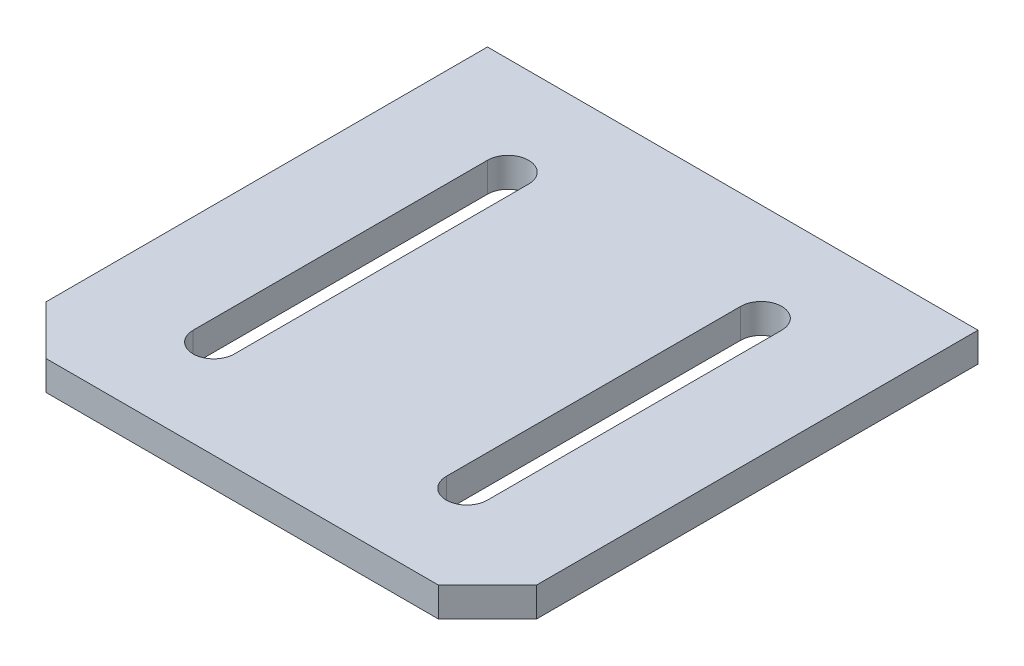
ISO-10303-21;
HEADER;
FILE_DESCRIPTION(('STEP AP214'),'2;1');
FILE_NAME('part.step','',(''),(''),'','','');
FILE_SCHEMA(('AUTOMOTIVE_DESIGN { 1 0 10303 214 1 1 1 1 }'));
ENDSEC;
DATA;
#1=APPLICATION_CONTEXT('core data for automotive mechanical design processes');
#2=APPLICATION_PROTOCOL_DEFINITION('international standard','automotive_design',2000,#1);
#3=PRODUCT_CONTEXT('',#1,'mechanical');
#4=PRODUCT('Part','Part','',(#3));
#5=PRODUCT_RELATED_PRODUCT_CATEGORY('part','',(#4));
#6=PRODUCT_DEFINITION_FORMATION('','',#4);
#7=PRODUCT_DEFINITION_CONTEXT('part definition',#1,'design');
#8=PRODUCT_DEFINITION('design','',#6,#7);
#9=PRODUCT_DEFINITION_SHAPE('','',#8);
#10=(LENGTH_UNIT() NAMED_UNIT(*) SI_UNIT(.MILLI.,.METRE.));
#11=(NAMED_UNIT(*) PLANE_ANGLE_UNIT() SI_UNIT($,.RADIAN.));
#12=(NAMED_UNIT(*) SI_UNIT($,.STERADIAN.) SOLID_ANGLE_UNIT());
#13=UNCERTAINTY_MEASURE_WITH_UNIT(LENGTH_MEASURE(1.E-05),#10,'distance_accuracy_value','');
#14=(GEOMETRIC_REPRESENTATION_CONTEXT(3) GLOBAL_UNCERTAINTY_ASSIGNED_CONTEXT((#13)) GLOBAL_UNIT_ASSIGNED_CONTEXT((#10,
#11,#12)) REPRESENTATION_CONTEXT('',''));
#15=CARTESIAN_POINT('',(0.,0.,0.));
#16=DIRECTION('',(0.,0.,1.));
#17=DIRECTION('',(1.,0.,0.));
#18=AXIS2_PLACEMENT_3D('',#15,#16,#17);
#19=CARTESIAN_POINT('',(25.,3.,25.));
#20=DIRECTION('',(-1.,0.,0.));
#21=DIRECTION('',(0.,0.,1.));
#22=AXIS2_PLACEMENT_3D('',#19,#20,#21);
#23=PLANE('',#22);
#24=DIRECTION('',(0.,0.,-1.));
#25=VECTOR('',#24,1.);
#26=CARTESIAN_POINT('',(25.,3.,25.));
#27=LINE('',#26,#25);
#28=CARTESIAN_POINT('',(25.,3.,20.));
#29=VERTEX_POINT('',#28);
#30=CARTESIAN_POINT('',(25.,3.,-25.));
#31=VERTEX_POINT('',#30);
#32=EDGE_CURVE('E210',#29,#31,#27,.T.);
#33=ORIENTED_EDGE('',*,*,#32,.F.);
#34=DIRECTION('',(0.,-1.,0.));
#35=VECTOR('',#34,1.);
#36=CARTESIAN_POINT('',(25.,3.,20.));
#37=LINE('',#36,#35);
#38=CARTESIAN_POINT('',(25.,0.,20.));
#39=VERTEX_POINT('',#38);
#40=EDGE_CURVE('E245',#29,#39,#37,.T.);
#41=ORIENTED_EDGE('',*,*,#40,.T.);
#42=DIRECTION('',(0.,0.,-1.));
#43=VECTOR('',#42,1.);
#44=CARTESIAN_POINT('',(25.,0.,25.));
#45=LINE('',#44,#43);
#46=CARTESIAN_POINT('',(25.,0.,-25.));
#47=VERTEX_POINT('',#46);
#48=EDGE_CURVE('E179',#39,#47,#45,.T.);
#49=ORIENTED_EDGE('',*,*,#48,.T.);
#50=DIRECTION('',(0.,-1.,0.));
#51=VECTOR('',#50,1.);
#52=CARTESIAN_POINT('',(25.,3.,-25.));
#53=LINE('',#52,#51);
#54=EDGE_CURVE('E241',#31,#47,#53,.T.);
#55=ORIENTED_EDGE('',*,*,#54,.F.);
#56=EDGE_LOOP('',(#33,#41,#49,#55));
#57=FACE_BOUND('',#56,.T.);
#58=ADVANCED_FACE('F41',(#57),#23,.F.);
#59=CARTESIAN_POINT('',(-25.,3.,-25.));
#60=DIRECTION('',(0.,0.,1.));
#61=DIRECTION('',(1.,0.,0.));
#62=AXIS2_PLACEMENT_3D('',#59,#60,#61);
#63=PLANE('',#62);
#64=DIRECTION('',(-1.,0.,0.));
#65=VECTOR('',#64,1.);
#66=CARTESIAN_POINT('',(-25.,0.,-25.));
#67=LINE('',#66,#65);
#68=CARTESIAN_POINT('',(-25.,0.,-25.));
#69=VERTEX_POINT('',#68);
#70=EDGE_CURVE('E228',#47,#69,#67,.T.);
#71=ORIENTED_EDGE('',*,*,#70,.T.);
#72=DIRECTION('',(0.,-1.,0.));
#73=VECTOR('',#72,1.);
#74=CARTESIAN_POINT('',(-25.,3.,-25.));
#75=LINE('',#74,#73);
#76=CARTESIAN_POINT('',(-25.,3.,-25.));
#77=VERTEX_POINT('',#76);
#78=EDGE_CURVE('E225',#77,#69,#75,.T.);
#79=ORIENTED_EDGE('',*,*,#78,.F.);
#80=DIRECTION('',(-1.,0.,0.));
#81=VECTOR('',#80,1.);
#82=CARTESIAN_POINT('',(-25.,3.,-25.));
#83=LINE('',#82,#81);
#84=EDGE_CURVE('E213',#31,#77,#83,.T.);
#85=ORIENTED_EDGE('',*,*,#84,.F.);
#86=ORIENTED_EDGE('',*,*,#54,.T.);
#87=EDGE_LOOP('',(#71,#79,#85,#86));
#88=FACE_BOUND('',#87,.T.);
#89=ADVANCED_FACE('F313',(#88),#63,.F.);
#90=CARTESIAN_POINT('',(-25.,3.,25.));
#91=DIRECTION('',(1.,0.,0.));
#92=DIRECTION('',(0.,0.,-1.));
#93=AXIS2_PLACEMENT_3D('',#90,#91,#92);
#94=PLANE('',#93);
#95=DIRECTION('',(0.,0.,1.));
#96=VECTOR('',#95,1.);
#97=CARTESIAN_POINT('',(-25.,0.,25.));
#98=LINE('',#97,#96);
#99=CARTESIAN_POINT('',(-25.,0.,20.));
#100=VERTEX_POINT('',#99);
#101=EDGE_CURVE('E231',#69,#100,#98,.T.);
#102=ORIENTED_EDGE('',*,*,#101,.T.);
#103=DIRECTION('',(0.,1.,0.));
#104=VECTOR('',#103,1.);
#105=CARTESIAN_POINT('',(-25.,3.,20.));
#106=LINE('',#105,#104);
#107=CARTESIAN_POINT('',(-25.,3.,20.));
#108=VERTEX_POINT('',#107);
#109=EDGE_CURVE('E268',#100,#108,#106,.T.);
#110=ORIENTED_EDGE('',*,*,#109,.T.);
#111=DIRECTION('',(0.,0.,1.));
#112=VECTOR('',#111,1.);
#113=CARTESIAN_POINT('',(-25.,3.,25.));
#114=LINE('',#113,#112);
#115=EDGE_CURVE('E217',#77,#108,#114,.T.);
#116=ORIENTED_EDGE('',*,*,#115,.F.);
#117=ORIENTED_EDGE('',*,*,#78,.T.);
#118=EDGE_LOOP('',(#102,#110,#116,#117));
#119=FACE_BOUND('',#118,.T.);
#120=ADVANCED_FACE('F319',(#119),#94,.F.);
#121=CARTESIAN_POINT('',(-25.,3.,25.));
#122=DIRECTION('',(0.,0.,-1.));
#123=DIRECTION('',(-1.,0.,0.));
#124=AXIS2_PLACEMENT_3D('',#121,#122,#123);
#125=PLANE('',#124);
#126=DIRECTION('',(1.,0.,0.));
#127=VECTOR('',#126,1.);
#128=CARTESIAN_POINT('',(-25.,0.,25.));
#129=LINE('',#128,#127);
#130=CARTESIAN_POINT('',(-20.,0.,25.));
#131=VERTEX_POINT('',#130);
#132=CARTESIAN_POINT('',(20.,0.,25.));
#133=VERTEX_POINT('',#132);
#134=EDGE_CURVE('E214',#131,#133,#129,.T.);
#135=ORIENTED_EDGE('',*,*,#134,.T.);
#136=DIRECTION('',(0.,1.,0.));
#137=VECTOR('',#136,1.);
#138=CARTESIAN_POINT('',(20.,3.,25.));
#139=LINE('',#138,#137);
#140=CARTESIAN_POINT('',(20.,3.,25.));
#141=VERTEX_POINT('',#140);
#142=EDGE_CURVE('E259',#133,#141,#139,.T.);
#143=ORIENTED_EDGE('',*,*,#142,.T.);
#144=DIRECTION('',(1.,0.,0.));
#145=VECTOR('',#144,1.);
#146=CARTESIAN_POINT('',(-25.,3.,25.));
#147=LINE('',#146,#145);
#148=CARTESIAN_POINT('',(-20.,3.,25.));
#149=VERTEX_POINT('',#148);
#150=EDGE_CURVE('E221',#149,#141,#147,.T.);
#151=ORIENTED_EDGE('',*,*,#150,.F.);
#152=DIRECTION('',(0.,-1.,0.));
#153=VECTOR('',#152,1.);
#154=CARTESIAN_POINT('',(-20.,3.,25.));
#155=LINE('',#154,#153);
#156=EDGE_CURVE('E255',#149,#131,#155,.T.);
#157=ORIENTED_EDGE('',*,*,#156,.T.);
#158=EDGE_LOOP('',(#135,#143,#151,#157));
#159=FACE_BOUND('',#158,.T.);
#160=ADVANCED_FACE('F354',(#159),#125,.F.);
#161=CARTESIAN_POINT('',(0.,3.,0.));
#162=DIRECTION('',(0.,-1.,0.));
#163=DIRECTION('',(0.,0.,-1.));
#164=AXIS2_PLACEMENT_3D('',#161,#162,#163);
#165=PLANE('',#164);
#166=CARTESIAN_POINT('',(-12.9,3.,15.));
#167=DIRECTION('',(0.,1.,0.));
#168=DIRECTION('',(0.,0.,1.));
#169=AXIS2_PLACEMENT_3D('',#166,#167,#168);
#170=CIRCLE('',#169,2.1);
#171=CARTESIAN_POINT('',(-10.8,3.,15.));
#172=VERTEX_POINT('',#171);
#173=CARTESIAN_POINT('',(-15.,3.,15.));
#174=VERTEX_POINT('',#173);
#175=EDGE_CURVE('E161',#172,#174,#170,.F.);
#176=ORIENTED_EDGE('',*,*,#175,.T.);
#177=DIRECTION('',(0.,0.,1.));
#178=VECTOR('',#177,1.);
#179=CARTESIAN_POINT('',(-15.,3.,0.));
#180=LINE('',#179,#178);
#181=CARTESIAN_POINT('',(-15.,3.,-15.));
#182=VERTEX_POINT('',#181);
#183=EDGE_CURVE('E58',#182,#174,#180,.T.);
#184=ORIENTED_EDGE('',*,*,#183,.F.);
#185=CARTESIAN_POINT('',(-12.9,3.,-15.));
#186=DIRECTION('',(0.,1.,0.));
#187=DIRECTION('',(0.,0.,1.));
#188=AXIS2_PLACEMENT_3D('',#185,#186,#187);
#189=CIRCLE('',#188,2.1);
#190=CARTESIAN_POINT('',(-10.8,3.,-15.));
#191=VERTEX_POINT('',#190);
#192=EDGE_CURVE('E169',#182,#191,#189,.F.);
#193=ORIENTED_EDGE('',*,*,#192,.T.);
#194=DIRECTION('',(0.,0.,1.));
#195=VECTOR('',#194,1.);
#196=CARTESIAN_POINT('',(-10.8,3.,0.));
#197=LINE('',#196,#195);
#198=EDGE_CURVE('E150',#191,#172,#197,.T.);
#199=ORIENTED_EDGE('',*,*,#198,.T.);
#200=EDGE_LOOP('',(#176,#184,#193,#199));
#201=FACE_BOUND('',#200,.T.);
#202=DIRECTION('',(0.,0.,1.));
#203=VECTOR('',#202,1.);
#204=CARTESIAN_POINT('',(15.,3.,0.));
#205=LINE('',#204,#203);
#206=CARTESIAN_POINT('',(15.,3.,-15.));
#207=VERTEX_POINT('',#206);
#208=CARTESIAN_POINT('',(15.,3.,15.));
#209=VERTEX_POINT('',#208);
#210=EDGE_CURVE('E186',#207,#209,#205,.T.);
#211=ORIENTED_EDGE('',*,*,#210,.T.);
#212=CARTESIAN_POINT('',(12.9,3.,15.));
#213=DIRECTION('',(0.,1.,0.));
#214=DIRECTION('',(0.,0.,1.));
#215=AXIS2_PLACEMENT_3D('',#212,#213,#214);
#216=CIRCLE('',#215,2.1);
#217=CARTESIAN_POINT('',(10.8,3.,15.));
#218=VERTEX_POINT('',#217);
#219=EDGE_CURVE('E66',#218,#209,#216,.T.);
#220=ORIENTED_EDGE('',*,*,#219,.F.);
#221=DIRECTION('',(0.,0.,1.));
#222=VECTOR('',#221,1.);
#223=CARTESIAN_POINT('',(10.8,3.,0.));
#224=LINE('',#223,#222);
#225=CARTESIAN_POINT('',(10.8,3.,-15.));
#226=VERTEX_POINT('',#225);
#227=EDGE_CURVE('E194',#226,#218,#224,.T.);
#228=ORIENTED_EDGE('',*,*,#227,.F.);
#229=CARTESIAN_POINT('',(12.9,3.,-15.));
#230=DIRECTION('',(0.,1.,0.));
#231=DIRECTION('',(0.,0.,1.));
#232=AXIS2_PLACEMENT_3D('',#229,#230,#231);
#233=CIRCLE('',#232,2.1);
#234=EDGE_CURVE('E190',#207,#226,#233,.T.);
#235=ORIENTED_EDGE('',*,*,#234,.F.);
#236=EDGE_LOOP('',(#211,#220,#228,#235));
#237=FACE_BOUND('',#236,.T.);
#238=ORIENTED_EDGE('',*,*,#150,.T.);
#239=DIRECTION('',(-0.707106781186549,0.,0.707106781186547));
#240=VECTOR('',#239,1.);
#241=CARTESIAN_POINT('',(25.,3.,20.));
#242=LINE('',#241,#240);
#243=EDGE_CURVE('E265',#141,#29,#242,.F.);
#244=ORIENTED_EDGE('',*,*,#243,.T.);
#245=ORIENTED_EDGE('',*,*,#32,.T.);
#246=ORIENTED_EDGE('',*,*,#84,.T.);
#247=ORIENTED_EDGE('',*,*,#115,.T.);
#248=DIRECTION('',(-0.707106781186547,0.,-0.707106781186549));
#249=VECTOR('',#248,1.);
#250=CARTESIAN_POINT('',(-20.,3.,25.));
#251=LINE('',#250,#249);
#252=EDGE_CURVE('E262',#108,#149,#251,.F.);
#253=ORIENTED_EDGE('',*,*,#252,.T.);
#254=EDGE_LOOP('',(#238,#244,#245,#246,#247,#253));
#255=FACE_BOUND('',#254,.T.);
#256=ADVANCED_FACE('F166',(#201,#237,#255),#165,.F.);
#257=CARTESIAN_POINT('',(0.,0.,0.));
#258=DIRECTION('',(0.,-1.,0.));
#259=DIRECTION('',(0.,0.,-1.));
#260=AXIS2_PLACEMENT_3D('',#257,#258,#259);
#261=PLANE('',#260);
#262=DIRECTION('',(0.,0.,-1.));
#263=VECTOR('',#262,1.);
#264=CARTESIAN_POINT('',(-15.,0.,0.));
#265=LINE('',#264,#263);
#266=CARTESIAN_POINT('',(-15.,0.,15.));
#267=VERTEX_POINT('',#266);
#268=CARTESIAN_POINT('',(-15.,0.,-15.));
#269=VERTEX_POINT('',#268);
#270=EDGE_CURVE('E11',#267,#269,#265,.T.);
#271=ORIENTED_EDGE('',*,*,#270,.F.);
#272=CARTESIAN_POINT('',(-12.9,0.,15.));
#273=DIRECTION('',(0.,-1.,0.));
#274=DIRECTION('',(0.,0.,-1.));
#275=AXIS2_PLACEMENT_3D('',#272,#273,#274);
#276=CIRCLE('',#275,2.1);
#277=CARTESIAN_POINT('',(-10.8,0.,15.));
#278=VERTEX_POINT('',#277);
#279=EDGE_CURVE('E285',#267,#278,#276,.F.);
#280=ORIENTED_EDGE('',*,*,#279,.T.);
#281=DIRECTION('',(0.,0.,-1.));
#282=VECTOR('',#281,1.);
#283=CARTESIAN_POINT('',(-10.8,0.,0.));
#284=LINE('',#283,#282);
#285=CARTESIAN_POINT('',(-10.8,0.,-15.));
#286=VERTEX_POINT('',#285);
#287=EDGE_CURVE('E153',#278,#286,#284,.T.);
#288=ORIENTED_EDGE('',*,*,#287,.T.);
#289=CARTESIAN_POINT('',(-12.9,0.,-15.));
#290=DIRECTION('',(0.,-1.,0.));
#291=DIRECTION('',(0.,0.,-1.));
#292=AXIS2_PLACEMENT_3D('',#289,#290,#291);
#293=CIRCLE('',#292,2.1);
#294=EDGE_CURVE('E51',#286,#269,#293,.F.);
#295=ORIENTED_EDGE('',*,*,#294,.T.);
#296=EDGE_LOOP('',(#271,#280,#288,#295));
#297=FACE_BOUND('',#296,.T.);
#298=CARTESIAN_POINT('',(12.9,0.,15.));
#299=DIRECTION('',(0.,-1.,0.));
#300=DIRECTION('',(0.,0.,-1.));
#301=AXIS2_PLACEMENT_3D('',#298,#299,#300);
#302=CIRCLE('',#301,2.1);
#303=CARTESIAN_POINT('',(15.,0.,15.));
#304=VERTEX_POINT('',#303);
#305=CARTESIAN_POINT('',(10.8,0.,15.));
#306=VERTEX_POINT('',#305);
#307=EDGE_CURVE('E282',#304,#306,#302,.T.);
#308=ORIENTED_EDGE('',*,*,#307,.F.);
#309=DIRECTION('',(0.,0.,-1.));
#310=VECTOR('',#309,1.);
#311=CARTESIAN_POINT('',(15.,0.,0.));
#312=LINE('',#311,#310);
#313=CARTESIAN_POINT('',(15.,0.,-15.));
#314=VERTEX_POINT('',#313);
#315=EDGE_CURVE('E271',#304,#314,#312,.T.);
#316=ORIENTED_EDGE('',*,*,#315,.T.);
#317=CARTESIAN_POINT('',(12.9,0.,-15.));
#318=DIRECTION('',(0.,-1.,0.));
#319=DIRECTION('',(0.,0.,-1.));
#320=AXIS2_PLACEMENT_3D('',#317,#318,#319);
#321=CIRCLE('',#320,2.1);
#322=CARTESIAN_POINT('',(10.8,0.,-15.));
#323=VERTEX_POINT('',#322);
#324=EDGE_CURVE('E275',#323,#314,#321,.T.);
#325=ORIENTED_EDGE('',*,*,#324,.F.);
#326=DIRECTION('',(0.,0.,-1.));
#327=VECTOR('',#326,1.);
#328=CARTESIAN_POINT('',(10.8,0.,0.));
#329=LINE('',#328,#327);
#330=EDGE_CURVE('E279',#306,#323,#329,.T.);
#331=ORIENTED_EDGE('',*,*,#330,.F.);
#332=EDGE_LOOP('',(#308,#316,#325,#331));
#333=FACE_BOUND('',#332,.T.);
#334=ORIENTED_EDGE('',*,*,#48,.F.);
#335=DIRECTION('',(0.707106781186549,0.,-0.707106781186547));
#336=VECTOR('',#335,1.);
#337=CARTESIAN_POINT('',(22.5,0.,22.5));
#338=LINE('',#337,#336);
#339=EDGE_CURVE('E252',#39,#133,#338,.F.);
#340=ORIENTED_EDGE('',*,*,#339,.T.);
#341=ORIENTED_EDGE('',*,*,#134,.F.);
#342=DIRECTION('',(0.707106781186547,0.,0.707106781186549));
#343=VECTOR('',#342,1.);
#344=CARTESIAN_POINT('',(-22.5,0.,22.5));
#345=LINE('',#344,#343);
#346=EDGE_CURVE('E249',#131,#100,#345,.F.);
#347=ORIENTED_EDGE('',*,*,#346,.T.);
#348=ORIENTED_EDGE('',*,*,#101,.F.);
#349=ORIENTED_EDGE('',*,*,#70,.F.);
#350=EDGE_LOOP('',(#334,#340,#341,#347,#348,#349));
#351=FACE_BOUND('',#350,.T.);
#352=ADVANCED_FACE('F293',(#297,#333,#351),#261,.T.);
#353=CARTESIAN_POINT('',(25.,3.,20.));
#354=DIRECTION('',(-0.707106781186547,0.,-0.707106781186549));
#355=DIRECTION('',(0.,-1.,0.));
#356=AXIS2_PLACEMENT_3D('',#353,#354,#355);
#357=PLANE('',#356);
#358=ORIENTED_EDGE('',*,*,#243,.F.);
#359=ORIENTED_EDGE('',*,*,#142,.F.);
#360=ORIENTED_EDGE('',*,*,#339,.F.);
#361=ORIENTED_EDGE('',*,*,#40,.F.);
#362=EDGE_LOOP('',(#358,#359,#360,#361));
#363=FACE_BOUND('',#362,.T.);
#364=ADVANCED_FACE('F325',(#363),#357,.F.);
#365=CARTESIAN_POINT('',(-20.,3.,25.));
#366=DIRECTION('',(0.707106781186549,0.,-0.707106781186547));
#367=DIRECTION('',(0.,-1.,0.));
#368=AXIS2_PLACEMENT_3D('',#365,#366,#367);
#369=PLANE('',#368);
#370=ORIENTED_EDGE('',*,*,#252,.F.);
#371=ORIENTED_EDGE('',*,*,#109,.F.);
#372=ORIENTED_EDGE('',*,*,#346,.F.);
#373=ORIENTED_EDGE('',*,*,#156,.F.);
#374=EDGE_LOOP('',(#370,#371,#372,#373));
#375=FACE_BOUND('',#374,.T.);
#376=ADVANCED_FACE('F44',(#375),#369,.F.);
#377=CARTESIAN_POINT('',(12.9,-7.,15.));
#378=DIRECTION('',(0.,1.,0.));
#379=DIRECTION('',(0.,0.,1.));
#380=AXIS2_PLACEMENT_3D('',#377,#378,#379);
#381=CYLINDRICAL_SURFACE('',#380,2.1);
#382=ORIENTED_EDGE('',*,*,#307,.T.);
#383=DIRECTION('',(0.,1.,0.));
#384=VECTOR('',#383,1.);
#385=CARTESIAN_POINT('',(10.8,-7.,15.));
#386=LINE('',#385,#384);
#387=EDGE_CURVE('E199',#306,#218,#386,.T.);
#388=ORIENTED_EDGE('',*,*,#387,.T.);
#389=ORIENTED_EDGE('',*,*,#219,.T.);
#390=DIRECTION('',(0.,1.,0.));
#391=VECTOR('',#390,1.);
#392=CARTESIAN_POINT('',(15.,-7.,15.));
#393=LINE('',#392,#391);
#394=EDGE_CURVE('E198',#304,#209,#393,.T.);
#395=ORIENTED_EDGE('',*,*,#394,.F.);
#396=EDGE_LOOP('',(#382,#388,#389,#395));
#397=FACE_BOUND('',#396,.T.);
#398=ADVANCED_FACE('F334',(#397),#381,.F.);
#399=CARTESIAN_POINT('',(10.8,-7.,0.));
#400=DIRECTION('',(-1.,0.,0.));
#401=DIRECTION('',(0.,0.,1.));
#402=AXIS2_PLACEMENT_3D('',#399,#400,#401);
#403=PLANE('',#402);
#404=ORIENTED_EDGE('',*,*,#330,.T.);
#405=DIRECTION('',(0.,1.,0.));
#406=VECTOR('',#405,1.);
#407=CARTESIAN_POINT('',(10.8,-7.,-15.));
#408=LINE('',#407,#406);
#409=EDGE_CURVE('E202',#323,#226,#408,.T.);
#410=ORIENTED_EDGE('',*,*,#409,.T.);
#411=ORIENTED_EDGE('',*,*,#227,.T.);
#412=ORIENTED_EDGE('',*,*,#387,.F.);
#413=EDGE_LOOP('',(#404,#410,#411,#412));
#414=FACE_BOUND('',#413,.T.);
#415=ADVANCED_FACE('F366',(#414),#403,.F.);
#416=CARTESIAN_POINT('',(12.9,-7.,-15.));
#417=DIRECTION('',(0.,1.,0.));
#418=DIRECTION('',(0.,0.,1.));
#419=AXIS2_PLACEMENT_3D('',#416,#417,#418);
#420=CYLINDRICAL_SURFACE('',#419,2.1);
#421=ORIENTED_EDGE('',*,*,#324,.T.);
#422=DIRECTION('',(0.,1.,0.));
#423=VECTOR('',#422,1.);
#424=CARTESIAN_POINT('',(15.,-7.,-15.));
#425=LINE('',#424,#423);
#426=EDGE_CURVE('E205',#314,#207,#425,.T.);
#427=ORIENTED_EDGE('',*,*,#426,.T.);
#428=ORIENTED_EDGE('',*,*,#234,.T.);
#429=ORIENTED_EDGE('',*,*,#409,.F.);
#430=EDGE_LOOP('',(#421,#427,#428,#429));
#431=FACE_BOUND('',#430,.T.);
#432=ADVANCED_FACE('F307',(#431),#420,.F.);
#433=CARTESIAN_POINT('',(15.,-7.,0.));
#434=DIRECTION('',(-1.,0.,0.));
#435=DIRECTION('',(0.,0.,1.));
#436=AXIS2_PLACEMENT_3D('',#433,#434,#435);
#437=PLANE('',#436);
#438=ORIENTED_EDGE('',*,*,#394,.T.);
#439=ORIENTED_EDGE('',*,*,#210,.F.);
#440=ORIENTED_EDGE('',*,*,#426,.F.);
#441=ORIENTED_EDGE('',*,*,#315,.F.);
#442=EDGE_LOOP('',(#438,#439,#440,#441));
#443=FACE_BOUND('',#442,.T.);
#444=ADVANCED_FACE('F300',(#443),#437,.T.);
#445=CARTESIAN_POINT('',(-15.,-7.,0.));
#446=DIRECTION('',(-1.,0.,0.));
#447=DIRECTION('',(0.,0.,1.));
#448=AXIS2_PLACEMENT_3D('',#445,#446,#447);
#449=PLANE('',#448);
#450=ORIENTED_EDGE('',*,*,#270,.T.);
#451=DIRECTION('',(0.,1.,0.));
#452=VECTOR('',#451,1.);
#453=CARTESIAN_POINT('',(-15.,-7.,-15.));
#454=LINE('',#453,#452);
#455=EDGE_CURVE('E176',#269,#182,#454,.T.);
#456=ORIENTED_EDGE('',*,*,#455,.T.);
#457=ORIENTED_EDGE('',*,*,#183,.T.);
#458=DIRECTION('',(0.,1.,0.));
#459=VECTOR('',#458,1.);
#460=CARTESIAN_POINT('',(-15.,-7.,15.));
#461=LINE('',#460,#459);
#462=EDGE_CURVE('E158',#267,#174,#461,.T.);
#463=ORIENTED_EDGE('',*,*,#462,.F.);
#464=EDGE_LOOP('',(#450,#456,#457,#463));
#465=FACE_BOUND('',#464,.T.);
#466=ADVANCED_FACE('F298',(#465),#449,.F.);
#467=CARTESIAN_POINT('',(-12.9,-7.,-15.));
#468=DIRECTION('',(0.,1.,0.));
#469=DIRECTION('',(0.,0.,1.));
#470=AXIS2_PLACEMENT_3D('',#467,#468,#469);
#471=CYLINDRICAL_SURFACE('',#470,2.1);
#472=DIRECTION('',(0.,1.,0.));
#473=VECTOR('',#472,1.);
#474=CARTESIAN_POINT('',(-10.8,-7.,-15.));
#475=LINE('',#474,#473);
#476=EDGE_CURVE('E157',#286,#191,#475,.T.);
#477=ORIENTED_EDGE('',*,*,#476,.T.);
#478=ORIENTED_EDGE('',*,*,#192,.F.);
#479=ORIENTED_EDGE('',*,*,#455,.F.);
#480=ORIENTED_EDGE('',*,*,#294,.F.);
#481=EDGE_LOOP('',(#477,#478,#479,#480));
#482=FACE_BOUND('',#481,.T.);
#483=ADVANCED_FACE('F297',(#482),#471,.F.);
#484=CARTESIAN_POINT('',(-10.8,-7.,0.));
#485=DIRECTION('',(-1.,0.,0.));
#486=DIRECTION('',(0.,0.,1.));
#487=AXIS2_PLACEMENT_3D('',#484,#485,#486);
#488=PLANE('',#487);
#489=DIRECTION('',(0.,1.,0.));
#490=VECTOR('',#489,1.);
#491=CARTESIAN_POINT('',(-10.8,-7.,15.));
#492=LINE('',#491,#490);
#493=EDGE_CURVE('E145',#278,#172,#492,.T.);
#494=ORIENTED_EDGE('',*,*,#493,.T.);
#495=ORIENTED_EDGE('',*,*,#198,.F.);
#496=ORIENTED_EDGE('',*,*,#476,.F.);
#497=ORIENTED_EDGE('',*,*,#287,.F.);
#498=EDGE_LOOP('',(#494,#495,#496,#497));
#499=FACE_BOUND('',#498,.T.);
#500=ADVANCED_FACE('F147',(#499),#488,.T.);
#501=CARTESIAN_POINT('',(-12.9,-7.,15.));
#502=DIRECTION('',(0.,1.,0.));
#503=DIRECTION('',(0.,0.,1.));
#504=AXIS2_PLACEMENT_3D('',#501,#502,#503);
#505=CYLINDRICAL_SURFACE('',#504,2.1);
#506=ORIENTED_EDGE('',*,*,#462,.T.);
#507=ORIENTED_EDGE('',*,*,#175,.F.);
#508=ORIENTED_EDGE('',*,*,#493,.F.);
#509=ORIENTED_EDGE('',*,*,#279,.F.);
#510=EDGE_LOOP('',(#506,#507,#508,#509));
#511=FACE_BOUND('',#510,.T.);
#512=ADVANCED_FACE('F162',(#511),#505,.F.);
#513=CLOSED_SHELL('',(#58,#89,#120,#160,#256,#352,#364,#376,#398,#415,#432,#444,#466,#483,#500,#512));
#514=MANIFOLD_SOLID_BREP('B2',#513);
#515=ADVANCED_BREP_SHAPE_REPRESENTATION('',(#18,#514),#14);
#516=SHAPE_DEFINITION_REPRESENTATION(#9,#515);
ENDSEC;
END-ISO-10303-21;
